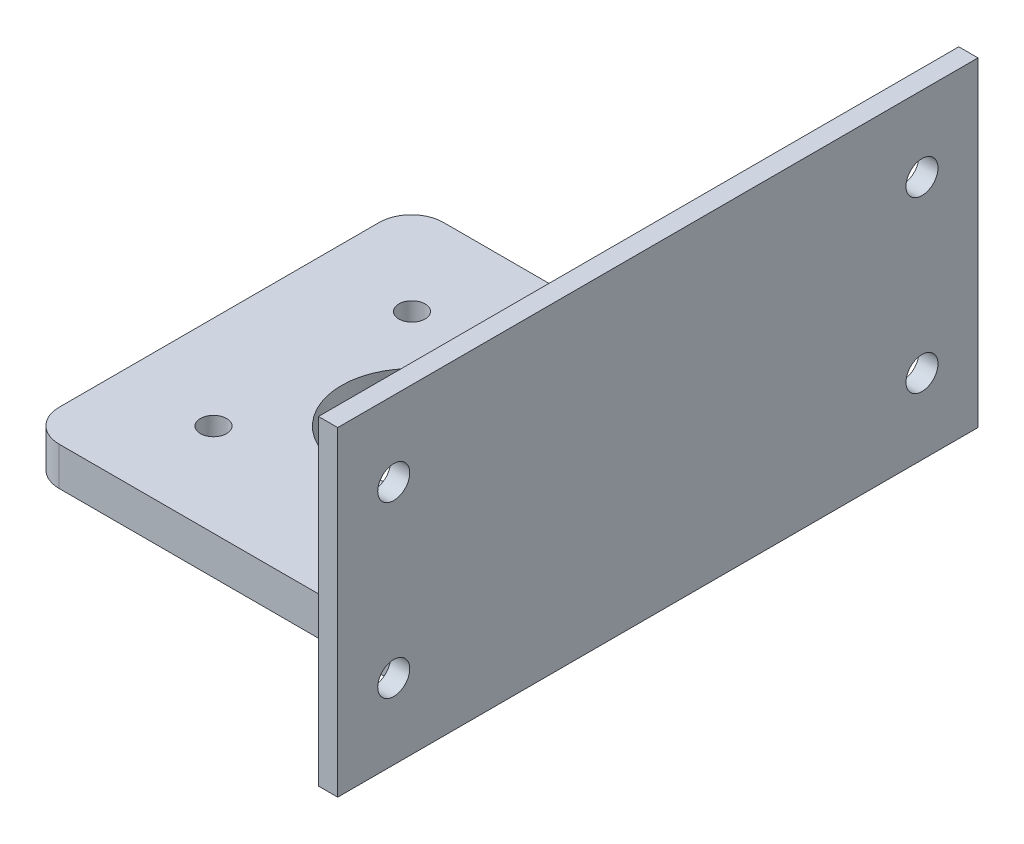
ISO-10303-21;
HEADER;
FILE_DESCRIPTION(('STEP AP214'),'2;1');
FILE_NAME('part.step','',(''),(''),'','','');
FILE_SCHEMA(('AUTOMOTIVE_DESIGN { 1 0 10303 214 1 1 1 1 }'));
ENDSEC;
DATA;
#1=APPLICATION_CONTEXT('core data for automotive mechanical design processes');
#2=APPLICATION_PROTOCOL_DEFINITION('international standard','automotive_design',2000,#1);
#3=PRODUCT_CONTEXT('',#1,'mechanical');
#4=PRODUCT('Part','Part','',(#3));
#5=PRODUCT_RELATED_PRODUCT_CATEGORY('part','',(#4));
#6=PRODUCT_DEFINITION_FORMATION('','',#4);
#7=PRODUCT_DEFINITION_CONTEXT('part definition',#1,'design');
#8=PRODUCT_DEFINITION('design','',#6,#7);
#9=PRODUCT_DEFINITION_SHAPE('','',#8);
#10=(LENGTH_UNIT() NAMED_UNIT(*) SI_UNIT(.MILLI.,.METRE.));
#11=(NAMED_UNIT(*) PLANE_ANGLE_UNIT() SI_UNIT($,.RADIAN.));
#12=(NAMED_UNIT(*) SI_UNIT($,.STERADIAN.) SOLID_ANGLE_UNIT());
#13=UNCERTAINTY_MEASURE_WITH_UNIT(LENGTH_MEASURE(1.E-05),#10,'distance_accuracy_value','');
#14=(GEOMETRIC_REPRESENTATION_CONTEXT(3) GLOBAL_UNCERTAINTY_ASSIGNED_CONTEXT((#13)) GLOBAL_UNIT_ASSIGNED_CONTEXT((#10,
#11,#12)) REPRESENTATION_CONTEXT('',''));
#15=CARTESIAN_POINT('',(0.,0.,0.));
#16=DIRECTION('',(0.,0.,1.));
#17=DIRECTION('',(1.,0.,0.));
#18=AXIS2_PLACEMENT_3D('',#15,#16,#17);
#19=CARTESIAN_POINT('',(0.,6.,60.));
#20=DIRECTION('',(1.,0.,0.));
#21=DIRECTION('',(0.,1.,0.));
#22=AXIS2_PLACEMENT_3D('',#19,#20,#21);
#23=PLANE('',#22);
#24=DIRECTION('',(0.,0.,-1.));
#25=VECTOR('',#24,1.);
#26=CARTESIAN_POINT('',(0.,0.,60.));
#27=LINE('',#26,#25);
#28=CARTESIAN_POINT('',(0.,0.,55.));
#29=VERTEX_POINT('',#28);
#30=CARTESIAN_POINT('',(0.,0.,5.));
#31=VERTEX_POINT('',#30);
#32=EDGE_CURVE('E225',#29,#31,#27,.T.);
#33=ORIENTED_EDGE('',*,*,#32,.F.);
#34=DIRECTION('',(0.,-1.,0.));
#35=VECTOR('',#34,1.);
#36=CARTESIAN_POINT('',(0.,6.,55.));
#37=LINE('',#36,#35);
#38=CARTESIAN_POINT('',(0.,6.,55.));
#39=VERTEX_POINT('',#38);
#40=EDGE_CURVE('E237',#29,#39,#37,.F.);
#41=ORIENTED_EDGE('',*,*,#40,.T.);
#42=DIRECTION('',(0.,0.,-1.));
#43=VECTOR('',#42,1.);
#44=CARTESIAN_POINT('',(0.,6.,60.));
#45=LINE('',#44,#43);
#46=CARTESIAN_POINT('',(0.,6.,5.));
#47=VERTEX_POINT('',#46);
#48=EDGE_CURVE('E207',#39,#47,#45,.T.);
#49=ORIENTED_EDGE('',*,*,#48,.T.);
#50=DIRECTION('',(0.,-1.,0.));
#51=VECTOR('',#50,1.);
#52=CARTESIAN_POINT('',(0.,6.,5.));
#53=LINE('',#52,#51);
#54=EDGE_CURVE('E234',#47,#31,#53,.T.);
#55=ORIENTED_EDGE('',*,*,#54,.T.);
#56=EDGE_LOOP('',(#33,#41,#49,#55));
#57=FACE_BOUND('',#56,.T.);
#58=ADVANCED_FACE('F36',(#57),#23,.F.);
#59=CARTESIAN_POINT('',(0.,0.,60.));
#60=DIRECTION('',(0.,1.,0.));
#61=DIRECTION('',(0.,0.,1.));
#62=AXIS2_PLACEMENT_3D('',#59,#60,#61);
#63=PLANE('',#62);
#64=CARTESIAN_POINT('',(14.6,0.,45.5));
#65=DIRECTION('',(0.,1.,0.));
#66=DIRECTION('',(-1.,0.,0.));
#67=AXIS2_PLACEMENT_3D('',#64,#65,#66);
#68=CIRCLE('',#67,2.05000000000001);
#69=CARTESIAN_POINT('',(12.55,0.,45.5));
#70=VERTEX_POINT('',#69);
#71=EDGE_CURVE('E190',#70,#70,#68,.T.);
#72=ORIENTED_EDGE('',*,*,#71,.T.);
#73=EDGE_LOOP('',(#72));
#74=FACE_BOUND('',#73,.T.);
#75=CARTESIAN_POINT('',(45.6,0.,45.5));
#76=DIRECTION('',(0.,1.,0.));
#77=DIRECTION('',(-1.,0.,0.));
#78=AXIS2_PLACEMENT_3D('',#75,#76,#77);
#79=CIRCLE('',#78,2.04999999999999);
#80=CARTESIAN_POINT('',(43.55,0.,45.5));
#81=VERTEX_POINT('',#80);
#82=EDGE_CURVE('E184',#81,#81,#79,.T.);
#83=ORIENTED_EDGE('',*,*,#82,.T.);
#84=EDGE_LOOP('',(#83));
#85=FACE_BOUND('',#84,.T.);
#86=CARTESIAN_POINT('',(45.6,0.,14.5));
#87=DIRECTION('',(0.,1.,0.));
#88=DIRECTION('',(-1.,0.,0.));
#89=AXIS2_PLACEMENT_3D('',#86,#87,#88);
#90=CIRCLE('',#89,2.04999999999999);
#91=CARTESIAN_POINT('',(43.55,0.,14.5));
#92=VERTEX_POINT('',#91);
#93=EDGE_CURVE('E178',#92,#92,#90,.T.);
#94=ORIENTED_EDGE('',*,*,#93,.T.);
#95=EDGE_LOOP('',(#94));
#96=FACE_BOUND('',#95,.T.);
#97=CARTESIAN_POINT('',(14.6,0.,14.5));
#98=DIRECTION('',(0.,1.,0.));
#99=DIRECTION('',(-1.,0.,0.));
#100=AXIS2_PLACEMENT_3D('',#97,#98,#99);
#101=CIRCLE('',#100,2.05);
#102=CARTESIAN_POINT('',(12.55,0.,14.5));
#103=VERTEX_POINT('',#102);
#104=EDGE_CURVE('E171',#103,#103,#101,.T.);
#105=ORIENTED_EDGE('',*,*,#104,.T.);
#106=EDGE_LOOP('',(#105));
#107=FACE_BOUND('',#106,.T.);
#108=CARTESIAN_POINT('',(30.1,0.,30.));
#109=DIRECTION('',(0.,1.,0.));
#110=DIRECTION('',(-1.,0.,0.));
#111=AXIS2_PLACEMENT_3D('',#108,#109,#110);
#112=CIRCLE('',#111,11.);
#113=CARTESIAN_POINT('',(19.1,0.,30.));
#114=VERTEX_POINT('',#113);
#115=EDGE_CURVE('E195',#114,#114,#112,.T.);
#116=ORIENTED_EDGE('',*,*,#115,.T.);
#117=EDGE_LOOP('',(#116));
#118=FACE_BOUND('',#117,.T.);
#119=DIRECTION('',(1.,0.,0.));
#120=VECTOR('',#119,1.);
#121=CARTESIAN_POINT('',(0.,0.,0.));
#122=LINE('',#121,#120);
#123=CARTESIAN_POINT('',(5.,0.,0.));
#124=VERTEX_POINT('',#123);
#125=CARTESIAN_POINT('',(65.5,0.,0.));
#126=VERTEX_POINT('',#125);
#127=EDGE_CURVE('E137',#124,#126,#122,.T.);
#128=ORIENTED_EDGE('',*,*,#127,.T.);
#129=DIRECTION('',(0.,0.,1.));
#130=VECTOR('',#129,1.);
#131=CARTESIAN_POINT('',(65.5,0.,80.));
#132=LINE('',#131,#130);
#133=CARTESIAN_POINT('',(65.5,0.,-20.));
#134=VERTEX_POINT('',#133);
#135=EDGE_CURVE('E135',#134,#126,#132,.T.);
#136=ORIENTED_EDGE('',*,*,#135,.F.);
#137=DIRECTION('',(-1.,0.,0.));
#138=VECTOR('',#137,1.);
#139=CARTESIAN_POINT('',(180.30339887499,0.,-20.));
#140=LINE('',#139,#138);
#141=CARTESIAN_POINT('',(68.5,0.,-20.));
#142=VERTEX_POINT('',#141);
#143=EDGE_CURVE('E122',#142,#134,#140,.T.);
#144=ORIENTED_EDGE('',*,*,#143,.F.);
#145=DIRECTION('',(0.,0.,-1.));
#146=VECTOR('',#145,1.);
#147=CARTESIAN_POINT('',(68.5,0.,60.));
#148=LINE('',#147,#146);
#149=CARTESIAN_POINT('',(68.5,0.,80.));
#150=VERTEX_POINT('',#149);
#151=EDGE_CURVE('E223',#150,#142,#148,.T.);
#152=ORIENTED_EDGE('',*,*,#151,.F.);
#153=DIRECTION('',(-1.,0.,0.));
#154=VECTOR('',#153,1.);
#155=CARTESIAN_POINT('',(180.30339887499,0.,80.));
#156=LINE('',#155,#154);
#157=CARTESIAN_POINT('',(65.5,0.,80.));
#158=VERTEX_POINT('',#157);
#159=EDGE_CURVE('E131',#150,#158,#156,.T.);
#160=ORIENTED_EDGE('',*,*,#159,.T.);
#161=CARTESIAN_POINT('',(65.5,0.,60.));
#162=VERTEX_POINT('',#161);
#163=EDGE_CURVE('E139',#162,#158,#132,.T.);
#164=ORIENTED_EDGE('',*,*,#163,.F.);
#165=DIRECTION('',(1.,0.,0.));
#166=VECTOR('',#165,1.);
#167=CARTESIAN_POINT('',(0.,0.,60.));
#168=LINE('',#167,#166);
#169=CARTESIAN_POINT('',(5.,0.,60.));
#170=VERTEX_POINT('',#169);
#171=EDGE_CURVE('E51',#170,#162,#168,.T.);
#172=ORIENTED_EDGE('',*,*,#171,.F.);
#173=CARTESIAN_POINT('',(5.,0.,55.));
#174=DIRECTION('',(0.,1.,0.));
#175=DIRECTION('',(0.,0.,1.));
#176=AXIS2_PLACEMENT_3D('',#173,#174,#175);
#177=CIRCLE('',#176,5.);
#178=EDGE_CURVE('E232',#170,#29,#177,.F.);
#179=ORIENTED_EDGE('',*,*,#178,.T.);
#180=ORIENTED_EDGE('',*,*,#32,.T.);
#181=CARTESIAN_POINT('',(5.,0.,5.));
#182=DIRECTION('',(0.,1.,0.));
#183=DIRECTION('',(0.,0.,1.));
#184=AXIS2_PLACEMENT_3D('',#181,#182,#183);
#185=CIRCLE('',#184,5.);
#186=EDGE_CURVE('E230',#31,#124,#185,.F.);
#187=ORIENTED_EDGE('',*,*,#186,.T.);
#188=EDGE_LOOP('',(#128,#136,#144,#152,#160,#164,#172,#179,#180,#187));
#189=FACE_BOUND('',#188,.T.);
#190=ADVANCED_FACE('F136',(#74,#85,#96,#107,#118,#189),#63,.F.);
#191=CARTESIAN_POINT('',(68.5,0.,60.));
#192=DIRECTION('',(-1.,0.,0.));
#193=DIRECTION('',(0.,0.,1.));
#194=AXIS2_PLACEMENT_3D('',#191,#192,#193);
#195=PLANE('',#194);
#196=ORIENTED_EDGE('',*,*,#151,.T.);
#197=DIRECTION('',(0.,1.,0.));
#198=VECTOR('',#197,1.);
#199=CARTESIAN_POINT('',(68.5,0.,-20.));
#200=LINE('',#199,#198);
#201=CARTESIAN_POINT('',(68.5,50.,-20.));
#202=VERTEX_POINT('',#201);
#203=EDGE_CURVE('E129',#142,#202,#200,.T.);
#204=ORIENTED_EDGE('',*,*,#203,.T.);
#205=DIRECTION('',(0.,0.,-1.));
#206=VECTOR('',#205,1.);
#207=CARTESIAN_POINT('',(68.5,50.,60.));
#208=LINE('',#207,#206);
#209=CARTESIAN_POINT('',(68.5,50.,80.));
#210=VERTEX_POINT('',#209);
#211=EDGE_CURVE('E221',#210,#202,#208,.T.);
#212=ORIENTED_EDGE('',*,*,#211,.F.);
#213=DIRECTION('',(0.,-1.,0.));
#214=VECTOR('',#213,1.);
#215=CARTESIAN_POINT('',(68.5,0.,80.));
#216=LINE('',#215,#214);
#217=EDGE_CURVE('E156',#210,#150,#216,.T.);
#218=ORIENTED_EDGE('',*,*,#217,.T.);
#219=EDGE_LOOP('',(#196,#204,#212,#218));
#220=FACE_BOUND('',#219,.T.);
#221=CARTESIAN_POINT('',(68.5,38.25,-11.25));
#222=DIRECTION('',(-1.,0.,0.));
#223=DIRECTION('',(0.,0.,1.));
#224=AXIS2_PLACEMENT_3D('',#221,#222,#223);
#225=CIRCLE('',#224,2.5);
#226=CARTESIAN_POINT('',(68.5,38.25,-8.75000000000001));
#227=VERTEX_POINT('',#226);
#228=EDGE_CURVE('E165',#227,#227,#225,.F.);
#229=ORIENTED_EDGE('',*,*,#228,.F.);
#230=EDGE_LOOP('',(#229));
#231=FACE_BOUND('',#230,.T.);
#232=CARTESIAN_POINT('',(68.5,11.75,-11.25));
#233=DIRECTION('',(-1.,0.,0.));
#234=DIRECTION('',(0.,0.,1.));
#235=AXIS2_PLACEMENT_3D('',#232,#233,#234);
#236=CIRCLE('',#235,2.5);
#237=CARTESIAN_POINT('',(68.5,11.75,-8.75));
#238=VERTEX_POINT('',#237);
#239=EDGE_CURVE('E166',#238,#238,#236,.F.);
#240=ORIENTED_EDGE('',*,*,#239,.F.);
#241=EDGE_LOOP('',(#240));
#242=FACE_BOUND('',#241,.T.);
#243=CARTESIAN_POINT('',(68.5,38.25,71.25));
#244=DIRECTION('',(-1.,0.,0.));
#245=DIRECTION('',(0.,0.,1.));
#246=AXIS2_PLACEMENT_3D('',#243,#244,#245);
#247=CIRCLE('',#246,2.5);
#248=CARTESIAN_POINT('',(68.5,38.25,73.75));
#249=VERTEX_POINT('',#248);
#250=EDGE_CURVE('E162',#249,#249,#247,.F.);
#251=ORIENTED_EDGE('',*,*,#250,.F.);
#252=EDGE_LOOP('',(#251));
#253=FACE_BOUND('',#252,.T.);
#254=CARTESIAN_POINT('',(68.5,11.75,71.25));
#255=DIRECTION('',(-1.,0.,0.));
#256=DIRECTION('',(0.,0.,1.));
#257=AXIS2_PLACEMENT_3D('',#254,#255,#256);
#258=CIRCLE('',#257,2.5);
#259=CARTESIAN_POINT('',(68.5,11.75,73.75));
#260=VERTEX_POINT('',#259);
#261=EDGE_CURVE('E170',#260,#260,#258,.F.);
#262=ORIENTED_EDGE('',*,*,#261,.F.);
#263=EDGE_LOOP('',(#262));
#264=FACE_BOUND('',#263,.T.);
#265=ADVANCED_FACE('F280',(#220,#231,#242,#253,#264),#195,.F.);
#266=CARTESIAN_POINT('',(68.5,50.,60.));
#267=DIRECTION('',(0.,-1.,0.));
#268=DIRECTION('',(0.,0.,-1.));
#269=AXIS2_PLACEMENT_3D('',#266,#267,#268);
#270=PLANE('',#269);
#271=ORIENTED_EDGE('',*,*,#211,.T.);
#272=DIRECTION('',(-1.,0.,0.));
#273=VECTOR('',#272,1.);
#274=CARTESIAN_POINT('',(180.30339887499,50.,-20.));
#275=LINE('',#274,#273);
#276=CARTESIAN_POINT('',(65.5,50.,-20.));
#277=VERTEX_POINT('',#276);
#278=EDGE_CURVE('E154',#202,#277,#275,.T.);
#279=ORIENTED_EDGE('',*,*,#278,.T.);
#280=DIRECTION('',(0.,0.,-1.));
#281=VECTOR('',#280,1.);
#282=CARTESIAN_POINT('',(65.5,50.,60.));
#283=LINE('',#282,#281);
#284=CARTESIAN_POINT('',(65.5,50.,80.));
#285=VERTEX_POINT('',#284);
#286=EDGE_CURVE('E144',#285,#277,#283,.T.);
#287=ORIENTED_EDGE('',*,*,#286,.F.);
#288=DIRECTION('',(-1.,0.,0.));
#289=VECTOR('',#288,1.);
#290=CARTESIAN_POINT('',(180.30339887499,50.,80.));
#291=LINE('',#290,#289);
#292=EDGE_CURVE('E157',#210,#285,#291,.T.);
#293=ORIENTED_EDGE('',*,*,#292,.F.);
#294=EDGE_LOOP('',(#271,#279,#287,#293));
#295=FACE_BOUND('',#294,.T.);
#296=ADVANCED_FACE('F273',(#295),#270,.F.);
#297=CARTESIAN_POINT('',(65.5,50.,60.));
#298=DIRECTION('',(1.,0.,0.));
#299=DIRECTION('',(0.,0.,-1.));
#300=AXIS2_PLACEMENT_3D('',#297,#298,#299);
#301=PLANE('',#300);
#302=ORIENTED_EDGE('',*,*,#286,.T.);
#303=DIRECTION('',(0.,-1.,0.));
#304=VECTOR('',#303,1.);
#305=CARTESIAN_POINT('',(65.5,0.,-20.));
#306=LINE('',#305,#304);
#307=EDGE_CURVE('E127',#277,#134,#306,.T.);
#308=ORIENTED_EDGE('',*,*,#307,.T.);
#309=ORIENTED_EDGE('',*,*,#135,.T.);
#310=DIRECTION('',(0.,-1.,0.));
#311=VECTOR('',#310,1.);
#312=CARTESIAN_POINT('',(65.5,0.,0.));
#313=LINE('',#312,#311);
#314=CARTESIAN_POINT('',(65.5,7.00000000000001,0.));
#315=VERTEX_POINT('',#314);
#316=EDGE_CURVE('E11',#315,#126,#313,.T.);
#317=ORIENTED_EDGE('',*,*,#316,.F.);
#318=DIRECTION('',(0.,0.,-1.));
#319=VECTOR('',#318,1.);
#320=CARTESIAN_POINT('',(65.5,7.00000000000001,60.));
#321=LINE('',#320,#319);
#322=CARTESIAN_POINT('',(65.5,7.00000000000001,60.));
#323=VERTEX_POINT('',#322);
#324=EDGE_CURVE('E217',#323,#315,#321,.T.);
#325=ORIENTED_EDGE('',*,*,#324,.F.);
#326=DIRECTION('',(0.,-1.,0.));
#327=VECTOR('',#326,1.);
#328=CARTESIAN_POINT('',(65.5,0.,60.));
#329=LINE('',#328,#327);
#330=EDGE_CURVE('E167',#323,#162,#329,.T.);
#331=ORIENTED_EDGE('',*,*,#330,.T.);
#332=ORIENTED_EDGE('',*,*,#163,.T.);
#333=DIRECTION('',(0.,1.,0.));
#334=VECTOR('',#333,1.);
#335=CARTESIAN_POINT('',(65.5,0.,80.));
#336=LINE('',#335,#334);
#337=EDGE_CURVE('E132',#158,#285,#336,.T.);
#338=ORIENTED_EDGE('',*,*,#337,.T.);
#339=EDGE_LOOP('',(#302,#308,#309,#317,#325,#331,#332,#338));
#340=FACE_BOUND('',#339,.T.);
#341=CARTESIAN_POINT('',(65.5,11.75,-11.25));
#342=DIRECTION('',(-1.,0.,0.));
#343=DIRECTION('',(0.,0.,-1.));
#344=AXIS2_PLACEMENT_3D('',#341,#342,#343);
#345=CIRCLE('',#344,2.5);
#346=CARTESIAN_POINT('',(65.5,11.75,-13.75));
#347=VERTEX_POINT('',#346);
#348=EDGE_CURVE('E149',#347,#347,#345,.T.);
#349=ORIENTED_EDGE('',*,*,#348,.F.);
#350=EDGE_LOOP('',(#349));
#351=FACE_BOUND('',#350,.T.);
#352=CARTESIAN_POINT('',(65.5,38.25,-11.25));
#353=DIRECTION('',(-1.,0.,0.));
#354=DIRECTION('',(0.,0.,1.));
#355=AXIS2_PLACEMENT_3D('',#352,#353,#354);
#356=CIRCLE('',#355,2.5);
#357=CARTESIAN_POINT('',(65.5,38.25,-8.75000000000001));
#358=VERTEX_POINT('',#357);
#359=EDGE_CURVE('E485',#358,#358,#356,.T.);
#360=ORIENTED_EDGE('',*,*,#359,.F.);
#361=EDGE_LOOP('',(#360));
#362=FACE_BOUND('',#361,.T.);
#363=CARTESIAN_POINT('',(65.5,38.25,71.25));
#364=DIRECTION('',(-1.,0.,0.));
#365=DIRECTION('',(0.,0.,-1.));
#366=AXIS2_PLACEMENT_3D('',#363,#364,#365);
#367=CIRCLE('',#366,2.5);
#368=CARTESIAN_POINT('',(65.5,38.25,68.75));
#369=VERTEX_POINT('',#368);
#370=EDGE_CURVE('E483',#369,#369,#367,.T.);
#371=ORIENTED_EDGE('',*,*,#370,.F.);
#372=EDGE_LOOP('',(#371));
#373=FACE_BOUND('',#372,.T.);
#374=CARTESIAN_POINT('',(65.5,11.75,71.25));
#375=DIRECTION('',(-1.,0.,0.));
#376=DIRECTION('',(0.,0.,1.));
#377=AXIS2_PLACEMENT_3D('',#374,#375,#376);
#378=CIRCLE('',#377,2.5);
#379=CARTESIAN_POINT('',(65.5,11.75,73.75));
#380=VERTEX_POINT('',#379);
#381=EDGE_CURVE('E146',#380,#380,#378,.T.);
#382=ORIENTED_EDGE('',*,*,#381,.F.);
#383=EDGE_LOOP('',(#382));
#384=FACE_BOUND('',#383,.T.);
#385=ADVANCED_FACE('F141',(#340,#351,#362,#373,#384),#301,.F.);
#386=CARTESIAN_POINT('',(65.5,7.00000000000001,60.));
#387=DIRECTION('',(0.707106781186542,-0.707106781186553,0.));
#388=DIRECTION('',(0.707106781186553,0.707106781186542,0.));
#389=AXIS2_PLACEMENT_3D('',#386,#387,#388);
#390=PLANE('',#389);
#391=DIRECTION('',(-0.707106781186553,-0.707106781186542,0.));
#392=VECTOR('',#391,1.);
#393=CARTESIAN_POINT('',(65.5,7.00000000000001,0.));
#394=LINE('',#393,#392);
#395=CARTESIAN_POINT('',(64.5,6.00000000000001,0.));
#396=VERTEX_POINT('',#395);
#397=EDGE_CURVE('E209',#315,#396,#394,.T.);
#398=ORIENTED_EDGE('',*,*,#397,.T.);
#399=DIRECTION('',(0.,0.,-1.));
#400=VECTOR('',#399,1.);
#401=CARTESIAN_POINT('',(64.5,6.00000000000001,60.));
#402=LINE('',#401,#400);
#403=CARTESIAN_POINT('',(64.5,6.00000000000001,60.));
#404=VERTEX_POINT('',#403);
#405=EDGE_CURVE('E214',#404,#396,#402,.T.);
#406=ORIENTED_EDGE('',*,*,#405,.F.);
#407=DIRECTION('',(-0.707106781186553,-0.707106781186542,0.));
#408=VECTOR('',#407,1.);
#409=CARTESIAN_POINT('',(65.5,7.00000000000001,60.));
#410=LINE('',#409,#408);
#411=EDGE_CURVE('E201',#323,#404,#410,.T.);
#412=ORIENTED_EDGE('',*,*,#411,.F.);
#413=ORIENTED_EDGE('',*,*,#324,.T.);
#414=EDGE_LOOP('',(#398,#406,#412,#413));
#415=FACE_BOUND('',#414,.T.);
#416=ADVANCED_FACE('F264',(#415),#390,.F.);
#417=CARTESIAN_POINT('',(64.5,6.00000000000001,60.));
#418=DIRECTION('',(0.,-1.,0.));
#419=DIRECTION('',(1.,0.,0.));
#420=AXIS2_PLACEMENT_3D('',#417,#418,#419);
#421=PLANE('',#420);
#422=CARTESIAN_POINT('',(14.6,6.,45.5));
#423=DIRECTION('',(0.,1.,0.));
#424=DIRECTION('',(-1.,0.,0.));
#425=AXIS2_PLACEMENT_3D('',#422,#423,#424);
#426=CIRCLE('',#425,2.05000000000001);
#427=CARTESIAN_POINT('',(12.55,6.,45.5));
#428=VERTEX_POINT('',#427);
#429=EDGE_CURVE('E169',#428,#428,#426,.T.);
#430=ORIENTED_EDGE('',*,*,#429,.F.);
#431=EDGE_LOOP('',(#430));
#432=FACE_BOUND('',#431,.T.);
#433=CARTESIAN_POINT('',(45.6,6.00000000000001,45.5));
#434=DIRECTION('',(0.,1.,0.));
#435=DIRECTION('',(-1.,0.,0.));
#436=AXIS2_PLACEMENT_3D('',#433,#434,#435);
#437=CIRCLE('',#436,2.04999999999999);
#438=CARTESIAN_POINT('',(43.55,6.00000000000001,45.5));
#439=VERTEX_POINT('',#438);
#440=EDGE_CURVE('E187',#439,#439,#437,.T.);
#441=ORIENTED_EDGE('',*,*,#440,.F.);
#442=EDGE_LOOP('',(#441));
#443=FACE_BOUND('',#442,.T.);
#444=CARTESIAN_POINT('',(45.6,6.00000000000001,14.5));
#445=DIRECTION('',(0.,1.,0.));
#446=DIRECTION('',(-1.,0.,0.));
#447=AXIS2_PLACEMENT_3D('',#444,#445,#446);
#448=CIRCLE('',#447,2.04999999999999);
#449=CARTESIAN_POINT('',(43.55,6.00000000000001,14.5));
#450=VERTEX_POINT('',#449);
#451=EDGE_CURVE('E181',#450,#450,#448,.T.);
#452=ORIENTED_EDGE('',*,*,#451,.F.);
#453=EDGE_LOOP('',(#452));
#454=FACE_BOUND('',#453,.T.);
#455=CARTESIAN_POINT('',(14.6,6.,14.5));
#456=DIRECTION('',(0.,1.,0.));
#457=DIRECTION('',(-1.,0.,0.));
#458=AXIS2_PLACEMENT_3D('',#455,#456,#457);
#459=CIRCLE('',#458,2.05);
#460=CARTESIAN_POINT('',(12.55,6.,14.5));
#461=VERTEX_POINT('',#460);
#462=EDGE_CURVE('E175',#461,#461,#459,.T.);
#463=ORIENTED_EDGE('',*,*,#462,.F.);
#464=EDGE_LOOP('',(#463));
#465=FACE_BOUND('',#464,.T.);
#466=CARTESIAN_POINT('',(30.1,6.,30.));
#467=DIRECTION('',(0.,1.,0.));
#468=DIRECTION('',(-1.,0.,0.));
#469=AXIS2_PLACEMENT_3D('',#466,#467,#468);
#470=CIRCLE('',#469,11.);
#471=CARTESIAN_POINT('',(19.1,6.,30.));
#472=VERTEX_POINT('',#471);
#473=EDGE_CURVE('E174',#472,#472,#470,.T.);
#474=ORIENTED_EDGE('',*,*,#473,.F.);
#475=EDGE_LOOP('',(#474));
#476=FACE_BOUND('',#475,.T.);
#477=ORIENTED_EDGE('',*,*,#48,.F.);
#478=CARTESIAN_POINT('',(5.,6.,55.));
#479=DIRECTION('',(0.,-1.,0.));
#480=DIRECTION('',(1.,0.,0.));
#481=AXIS2_PLACEMENT_3D('',#478,#479,#480);
#482=CIRCLE('',#481,5.);
#483=CARTESIAN_POINT('',(5.,6.,60.));
#484=VERTEX_POINT('',#483);
#485=EDGE_CURVE('E241',#39,#484,#482,.F.);
#486=ORIENTED_EDGE('',*,*,#485,.T.);
#487=DIRECTION('',(-1.,0.,0.));
#488=VECTOR('',#487,1.);
#489=CARTESIAN_POINT('',(64.5,6.00000000000001,60.));
#490=LINE('',#489,#488);
#491=EDGE_CURVE('E204',#404,#484,#490,.T.);
#492=ORIENTED_EDGE('',*,*,#491,.F.);
#493=ORIENTED_EDGE('',*,*,#405,.T.);
#494=DIRECTION('',(-1.,0.,0.));
#495=VECTOR('',#494,1.);
#496=CARTESIAN_POINT('',(64.5,6.00000000000001,0.));
#497=LINE('',#496,#495);
#498=CARTESIAN_POINT('',(5.,6.,0.));
#499=VERTEX_POINT('',#498);
#500=EDGE_CURVE('E202',#396,#499,#497,.T.);
#501=ORIENTED_EDGE('',*,*,#500,.T.);
#502=CARTESIAN_POINT('',(5.,6.,5.));
#503=DIRECTION('',(0.,-1.,0.));
#504=DIRECTION('',(1.,0.,0.));
#505=AXIS2_PLACEMENT_3D('',#502,#503,#504);
#506=CIRCLE('',#505,5.);
#507=EDGE_CURVE('E239',#499,#47,#506,.F.);
#508=ORIENTED_EDGE('',*,*,#507,.T.);
#509=EDGE_LOOP('',(#477,#486,#492,#493,#501,#508));
#510=FACE_BOUND('',#509,.T.);
#511=ADVANCED_FACE('F246',(#432,#443,#454,#465,#476,#510),#421,.F.);
#512=CARTESIAN_POINT('',(0.,0.,60.));
#513=DIRECTION('',(0.,0.,1.));
#514=DIRECTION('',(1.,0.,0.));
#515=AXIS2_PLACEMENT_3D('',#512,#513,#514);
#516=PLANE('',#515);
#517=ORIENTED_EDGE('',*,*,#330,.F.);
#518=ORIENTED_EDGE('',*,*,#411,.T.);
#519=ORIENTED_EDGE('',*,*,#491,.T.);
#520=DIRECTION('',(0.,-1.,0.));
#521=VECTOR('',#520,1.);
#522=CARTESIAN_POINT('',(5.,0.,60.));
#523=LINE('',#522,#521);
#524=EDGE_CURVE('E228',#484,#170,#523,.T.);
#525=ORIENTED_EDGE('',*,*,#524,.T.);
#526=ORIENTED_EDGE('',*,*,#171,.T.);
#527=EDGE_LOOP('',(#517,#518,#519,#525,#526));
#528=FACE_BOUND('',#527,.T.);
#529=ADVANCED_FACE('F250',(#528),#516,.T.);
#530=CARTESIAN_POINT('',(0.,0.,0.));
#531=DIRECTION('',(0.,0.,1.));
#532=DIRECTION('',(1.,0.,0.));
#533=AXIS2_PLACEMENT_3D('',#530,#531,#532);
#534=PLANE('',#533);
#535=ORIENTED_EDGE('',*,*,#397,.F.);
#536=ORIENTED_EDGE('',*,*,#316,.T.);
#537=ORIENTED_EDGE('',*,*,#127,.F.);
#538=DIRECTION('',(0.,-1.,0.));
#539=VECTOR('',#538,1.);
#540=CARTESIAN_POINT('',(5.,0.,0.));
#541=LINE('',#540,#539);
#542=EDGE_CURVE('E44',#124,#499,#541,.F.);
#543=ORIENTED_EDGE('',*,*,#542,.T.);
#544=ORIENTED_EDGE('',*,*,#500,.F.);
#545=EDGE_LOOP('',(#535,#536,#537,#543,#544));
#546=FACE_BOUND('',#545,.T.);
#547=ADVANCED_FACE('F261',(#546),#534,.F.);
#548=CARTESIAN_POINT('',(30.1,0.,30.));
#549=DIRECTION('',(0.,1.,0.));
#550=DIRECTION('',(-1.,0.,0.));
#551=AXIS2_PLACEMENT_3D('',#548,#549,#550);
#552=CYLINDRICAL_SURFACE('',#551,11.);
#553=ORIENTED_EDGE('',*,*,#115,.F.);
#554=EDGE_LOOP('',(#553));
#555=FACE_BOUND('',#554,.T.);
#556=ORIENTED_EDGE('',*,*,#473,.T.);
#557=EDGE_LOOP('',(#556));
#558=FACE_BOUND('',#557,.T.);
#559=ADVANCED_FACE('F303',(#555,#558),#552,.F.);
#560=CARTESIAN_POINT('',(14.6,0.,14.5));
#561=DIRECTION('',(0.,1.,0.));
#562=DIRECTION('',(-1.,0.,0.));
#563=AXIS2_PLACEMENT_3D('',#560,#561,#562);
#564=CYLINDRICAL_SURFACE('',#563,2.05);
#565=ORIENTED_EDGE('',*,*,#104,.F.);
#566=EDGE_LOOP('',(#565));
#567=FACE_BOUND('',#566,.T.);
#568=ORIENTED_EDGE('',*,*,#462,.T.);
#569=EDGE_LOOP('',(#568));
#570=FACE_BOUND('',#569,.T.);
#571=ADVANCED_FACE('F306',(#567,#570),#564,.F.);
#572=CARTESIAN_POINT('',(45.6,0.,14.5));
#573=DIRECTION('',(0.,1.,0.));
#574=DIRECTION('',(-1.,0.,0.));
#575=AXIS2_PLACEMENT_3D('',#572,#573,#574);
#576=CYLINDRICAL_SURFACE('',#575,2.04999999999999);
#577=ORIENTED_EDGE('',*,*,#93,.F.);
#578=EDGE_LOOP('',(#577));
#579=FACE_BOUND('',#578,.T.);
#580=ORIENTED_EDGE('',*,*,#451,.T.);
#581=EDGE_LOOP('',(#580));
#582=FACE_BOUND('',#581,.T.);
#583=ADVANCED_FACE('F296',(#579,#582),#576,.F.);
#584=CARTESIAN_POINT('',(45.6,0.,45.5));
#585=DIRECTION('',(0.,1.,0.));
#586=DIRECTION('',(-1.,0.,0.));
#587=AXIS2_PLACEMENT_3D('',#584,#585,#586);
#588=CYLINDRICAL_SURFACE('',#587,2.04999999999999);
#589=ORIENTED_EDGE('',*,*,#82,.F.);
#590=EDGE_LOOP('',(#589));
#591=FACE_BOUND('',#590,.T.);
#592=ORIENTED_EDGE('',*,*,#440,.T.);
#593=EDGE_LOOP('',(#592));
#594=FACE_BOUND('',#593,.T.);
#595=ADVANCED_FACE('F290',(#591,#594),#588,.F.);
#596=CARTESIAN_POINT('',(14.6,0.,45.5));
#597=DIRECTION('',(0.,1.,0.));
#598=DIRECTION('',(-1.,0.,0.));
#599=AXIS2_PLACEMENT_3D('',#596,#597,#598);
#600=CYLINDRICAL_SURFACE('',#599,2.05000000000001);
#601=ORIENTED_EDGE('',*,*,#71,.F.);
#602=EDGE_LOOP('',(#601));
#603=FACE_BOUND('',#602,.T.);
#604=ORIENTED_EDGE('',*,*,#429,.T.);
#605=EDGE_LOOP('',(#604));
#606=FACE_BOUND('',#605,.T.);
#607=ADVANCED_FACE('F285',(#603,#606),#600,.F.);
#608=CARTESIAN_POINT('',(5.,0.,55.));
#609=DIRECTION('',(0.,1.,0.));
#610=DIRECTION('',(-1.,0.,0.));
#611=AXIS2_PLACEMENT_3D('',#608,#609,#610);
#612=CYLINDRICAL_SURFACE('',#611,5.);
#613=ORIENTED_EDGE('',*,*,#485,.F.);
#614=ORIENTED_EDGE('',*,*,#40,.F.);
#615=ORIENTED_EDGE('',*,*,#178,.F.);
#616=ORIENTED_EDGE('',*,*,#524,.F.);
#617=EDGE_LOOP('',(#613,#614,#615,#616));
#618=FACE_BOUND('',#617,.T.);
#619=ADVANCED_FACE('F253',(#618),#612,.T.);
#620=CARTESIAN_POINT('',(5.,6.,5.));
#621=DIRECTION('',(0.,-1.,0.));
#622=DIRECTION('',(1.,0.,0.));
#623=AXIS2_PLACEMENT_3D('',#620,#621,#622);
#624=CYLINDRICAL_SURFACE('',#623,5.);
#625=ORIENTED_EDGE('',*,*,#507,.F.);
#626=ORIENTED_EDGE('',*,*,#542,.F.);
#627=ORIENTED_EDGE('',*,*,#186,.F.);
#628=ORIENTED_EDGE('',*,*,#54,.F.);
#629=EDGE_LOOP('',(#625,#626,#627,#628));
#630=FACE_BOUND('',#629,.T.);
#631=ADVANCED_FACE('F38',(#630),#624,.T.);
#632=CARTESIAN_POINT('',(180.30339887499,0.,-20.));
#633=DIRECTION('',(0.,0.,-1.));
#634=DIRECTION('',(-1.,0.,0.));
#635=AXIS2_PLACEMENT_3D('',#632,#633,#634);
#636=PLANE('',#635);
#637=ORIENTED_EDGE('',*,*,#203,.F.);
#638=ORIENTED_EDGE('',*,*,#143,.T.);
#639=ORIENTED_EDGE('',*,*,#307,.F.);
#640=ORIENTED_EDGE('',*,*,#278,.F.);
#641=EDGE_LOOP('',(#637,#638,#639,#640));
#642=FACE_BOUND('',#641,.T.);
#643=ADVANCED_FACE('F124',(#642),#636,.T.);
#644=CARTESIAN_POINT('',(180.30339887499,11.75,-11.25));
#645=DIRECTION('',(-1.,0.,0.));
#646=DIRECTION('',(0.,0.,1.));
#647=AXIS2_PLACEMENT_3D('',#644,#645,#646);
#648=CYLINDRICAL_SURFACE('',#647,2.5);
#649=ORIENTED_EDGE('',*,*,#239,.T.);
#650=EDGE_LOOP('',(#649));
#651=FACE_BOUND('',#650,.T.);
#652=ORIENTED_EDGE('',*,*,#348,.T.);
#653=EDGE_LOOP('',(#652));
#654=FACE_BOUND('',#653,.T.);
#655=ADVANCED_FACE('F427',(#651,#654),#648,.F.);
#656=CARTESIAN_POINT('',(180.30339887499,38.25,-11.25));
#657=DIRECTION('',(-1.,0.,0.));
#658=DIRECTION('',(0.,0.,1.));
#659=AXIS2_PLACEMENT_3D('',#656,#657,#658);
#660=CYLINDRICAL_SURFACE('',#659,2.5);
#661=ORIENTED_EDGE('',*,*,#228,.T.);
#662=EDGE_LOOP('',(#661));
#663=FACE_BOUND('',#662,.T.);
#664=ORIENTED_EDGE('',*,*,#359,.T.);
#665=EDGE_LOOP('',(#664));
#666=FACE_BOUND('',#665,.T.);
#667=ADVANCED_FACE('F435',(#663,#666),#660,.F.);
#668=CARTESIAN_POINT('',(180.30339887499,0.,80.));
#669=DIRECTION('',(0.,0.,1.));
#670=DIRECTION('',(1.,0.,0.));
#671=AXIS2_PLACEMENT_3D('',#668,#669,#670);
#672=PLANE('',#671);
#673=ORIENTED_EDGE('',*,*,#217,.F.);
#674=ORIENTED_EDGE('',*,*,#292,.T.);
#675=ORIENTED_EDGE('',*,*,#337,.F.);
#676=ORIENTED_EDGE('',*,*,#159,.F.);
#677=EDGE_LOOP('',(#673,#674,#675,#676));
#678=FACE_BOUND('',#677,.T.);
#679=ADVANCED_FACE('F444',(#678),#672,.T.);
#680=CARTESIAN_POINT('',(180.30339887499,11.75,71.25));
#681=DIRECTION('',(-1.,0.,0.));
#682=DIRECTION('',(0.,0.,1.));
#683=AXIS2_PLACEMENT_3D('',#680,#681,#682);
#684=CYLINDRICAL_SURFACE('',#683,2.5);
#685=ORIENTED_EDGE('',*,*,#261,.T.);
#686=EDGE_LOOP('',(#685));
#687=FACE_BOUND('',#686,.T.);
#688=ORIENTED_EDGE('',*,*,#381,.T.);
#689=EDGE_LOOP('',(#688));
#690=FACE_BOUND('',#689,.T.);
#691=ADVANCED_FACE('F453',(#687,#690),#684,.F.);
#692=CARTESIAN_POINT('',(180.30339887499,38.25,71.25));
#693=DIRECTION('',(-1.,0.,0.));
#694=DIRECTION('',(0.,0.,1.));
#695=AXIS2_PLACEMENT_3D('',#692,#693,#694);
#696=CYLINDRICAL_SURFACE('',#695,2.5);
#697=ORIENTED_EDGE('',*,*,#250,.T.);
#698=EDGE_LOOP('',(#697));
#699=FACE_BOUND('',#698,.T.);
#700=ORIENTED_EDGE('',*,*,#370,.T.);
#701=EDGE_LOOP('',(#700));
#702=FACE_BOUND('',#701,.T.);
#703=ADVANCED_FACE('F462',(#699,#702),#696,.F.);
#704=CLOSED_SHELL('',(#58,#190,#265,#296,#385,#416,#511,#529,#547,#559,#571,#583,#595,#607,#619,
#631,#643,#655,#667,#679,#691,#703));
#705=MANIFOLD_SOLID_BREP('B2',#704);
#706=ADVANCED_BREP_SHAPE_REPRESENTATION('',(#18,#705),#14);
#707=SHAPE_DEFINITION_REPRESENTATION(#9,#706);
ENDSEC;
END-ISO-10303-21;
